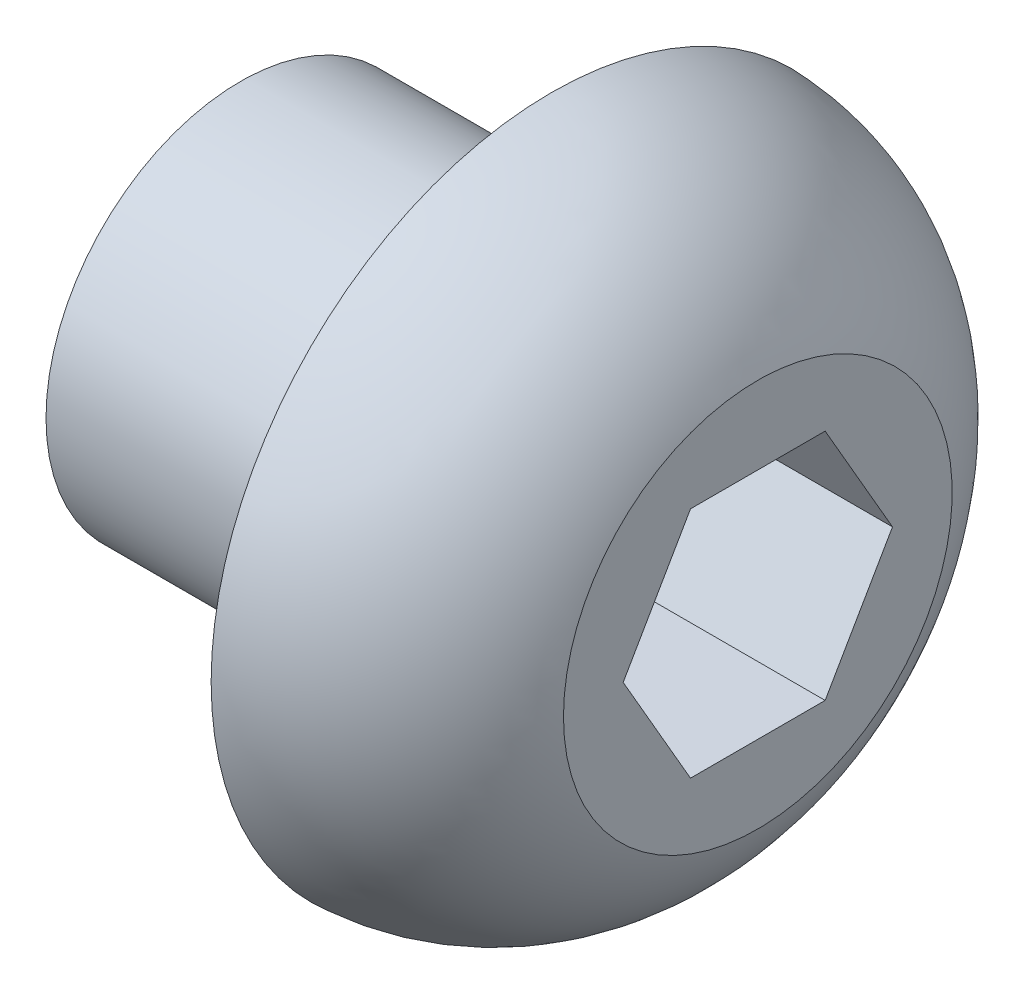
ISO-10303-21;
HEADER;
FILE_DESCRIPTION(('STEP AP214'),'2;1');
FILE_NAME('part.step','',(''),(''),'','','');
FILE_SCHEMA(('AUTOMOTIVE_DESIGN { 1 0 10303 214 1 1 1 1 }'));
ENDSEC;
DATA;
#1=APPLICATION_CONTEXT('core data for automotive mechanical design processes');
#2=APPLICATION_PROTOCOL_DEFINITION('international standard','automotive_design',2000,#1);
#3=PRODUCT_CONTEXT('',#1,'mechanical');
#4=PRODUCT('Part','Part','',(#3));
#5=PRODUCT_RELATED_PRODUCT_CATEGORY('part','',(#4));
#6=PRODUCT_DEFINITION_FORMATION('','',#4);
#7=PRODUCT_DEFINITION_CONTEXT('part definition',#1,'design');
#8=PRODUCT_DEFINITION('design','',#6,#7);
#9=PRODUCT_DEFINITION_SHAPE('','',#8);
#10=(LENGTH_UNIT() NAMED_UNIT(*) SI_UNIT(.MILLI.,.METRE.));
#11=(NAMED_UNIT(*) PLANE_ANGLE_UNIT() SI_UNIT($,.RADIAN.));
#12=(NAMED_UNIT(*) SI_UNIT($,.STERADIAN.) SOLID_ANGLE_UNIT());
#13=UNCERTAINTY_MEASURE_WITH_UNIT(LENGTH_MEASURE(1.E-05),#10,'distance_accuracy_value','');
#14=(GEOMETRIC_REPRESENTATION_CONTEXT(3) GLOBAL_UNCERTAINTY_ASSIGNED_CONTEXT((#13)) GLOBAL_UNIT_ASSIGNED_CONTEXT((#10,
#11,#12)) REPRESENTATION_CONTEXT('',''));
#15=CARTESIAN_POINT('',(0.,0.,0.));
#16=DIRECTION('',(0.,0.,1.));
#17=DIRECTION('',(1.,0.,0.));
#18=AXIS2_PLACEMENT_3D('',#15,#16,#17);
#19=CARTESIAN_POINT('',(0.,0.,0.));
#20=DIRECTION('',(1.,0.,0.));
#21=DIRECTION('',(0.,0.,-1.));
#22=AXIS2_PLACEMENT_3D('',#19,#20,#21);
#23=PLANE('',#22);
#24=CARTESIAN_POINT('',(0.,0.,0.));
#25=DIRECTION('',(-1.,0.,0.));
#26=DIRECTION('',(0.,0.,1.));
#27=AXIS2_PLACEMENT_3D('',#24,#25,#26);
#28=CIRCLE('',#27,3.96875);
#29=CARTESIAN_POINT('',(0.,0.,3.96875));
#30=VERTEX_POINT('',#29);
#31=EDGE_CURVE('E11',#30,#30,#28,.T.);
#32=ORIENTED_EDGE('',*,*,#31,.T.);
#33=EDGE_LOOP('',(#32));
#34=FACE_BOUND('',#33,.T.);
#35=ADVANCED_FACE('F32',(#34),#23,.F.);
#36=CARTESIAN_POINT('',(-7.10959552912187,0.,0.));
#37=DIRECTION('',(-1.,0.,0.));
#38=DIRECTION('',(0.,0.,1.));
#39=AXIS2_PLACEMENT_3D('',#36,#37,#38);
#40=CYLINDRICAL_SURFACE('',#39,3.96875);
#41=ORIENTED_EDGE('',*,*,#31,.F.);
#42=EDGE_LOOP('',(#41));
#43=FACE_BOUND('',#42,.T.);
#44=CARTESIAN_POINT('',(6.35,0.,0.));
#45=DIRECTION('',(-1.,0.,0.));
#46=DIRECTION('',(0.,0.,1.));
#47=AXIS2_PLACEMENT_3D('',#44,#45,#46);
#48=CIRCLE('',#47,3.96875);
#49=CARTESIAN_POINT('',(6.35,0.,3.96875));
#50=VERTEX_POINT('',#49);
#51=EDGE_CURVE('E39',#50,#50,#48,.T.);
#52=ORIENTED_EDGE('',*,*,#51,.T.);
#53=EDGE_LOOP('',(#52));
#54=FACE_BOUND('',#53,.T.);
#55=ADVANCED_FACE('F148',(#43,#54),#40,.T.);
#56=CARTESIAN_POINT('',(6.35,3.96875,0.));
#57=DIRECTION('',(1.,0.,0.));
#58=DIRECTION('',(0.,0.,-1.));
#59=AXIS2_PLACEMENT_3D('',#56,#57,#58);
#60=PLANE('',#59);
#61=ORIENTED_EDGE('',*,*,#51,.F.);
#62=EDGE_LOOP('',(#61));
#63=FACE_BOUND('',#62,.T.);
#64=CARTESIAN_POINT('',(6.35,0.,0.));
#65=DIRECTION('',(-1.,0.,0.));
#66=DIRECTION('',(0.,0.,1.));
#67=AXIS2_PLACEMENT_3D('',#64,#65,#66);
#68=CIRCLE('',#67,6.9469);
#69=CARTESIAN_POINT('',(6.35,0.,6.9469));
#70=VERTEX_POINT('',#69);
#71=EDGE_CURVE('E143',#70,#70,#68,.T.);
#72=ORIENTED_EDGE('',*,*,#71,.T.);
#73=EDGE_LOOP('',(#72));
#74=FACE_BOUND('',#73,.T.);
#75=ADVANCED_FACE('F150',(#63,#74),#60,.F.);
#76=CARTESIAN_POINT('',(6.12946561422209,0.,0.));
#77=DIRECTION('',(-1.,0.,0.));
#78=DIRECTION('',(0.,0.,1.));
#79=AXIS2_PLACEMENT_3D('',#76,#77,#78);
#80=DEGENERATE_TOROIDAL_SURFACE('',#79,2.16085350286454,4.79112476231344,.T.);
#81=ORIENTED_EDGE('',*,*,#71,.F.);
#82=EDGE_LOOP('',(#81));
#83=FACE_BOUND('',#82,.T.);
#84=CARTESIAN_POINT('',(10.5664,0.,0.));
#85=DIRECTION('',(-1.,0.,0.));
#86=DIRECTION('',(0.,0.,1.));
#87=AXIS2_PLACEMENT_3D('',#84,#85,#86);
#88=CIRCLE('',#87,3.96875);
#89=CARTESIAN_POINT('',(10.5664,0.,3.96875));
#90=VERTEX_POINT('',#89);
#91=EDGE_CURVE('E134',#90,#90,#88,.T.);
#92=ORIENTED_EDGE('',*,*,#91,.T.);
#93=EDGE_LOOP('',(#92));
#94=FACE_BOUND('',#93,.T.);
#95=ADVANCED_FACE('F153',(#83,#94),#80,.T.);
#96=CARTESIAN_POINT('',(10.5664,0.,0.));
#97=DIRECTION('',(-1.,0.,0.));
#98=DIRECTION('',(0.,0.,1.));
#99=AXIS2_PLACEMENT_3D('',#96,#97,#98);
#100=PLANE('',#99);
#101=DIRECTION('',(0.,0.866025403784439,0.5));
#102=VECTOR('',#101,1.);
#103=CARTESIAN_POINT('',(10.5664,0.,-2.74963065701559));
#104=LINE('',#103,#102);
#105=CARTESIAN_POINT('',(10.5664,0.,-2.74963065701559));
#106=VERTEX_POINT('',#105);
#107=CARTESIAN_POINT('',(10.5664,2.38125,-1.3748153285078));
#108=VERTEX_POINT('',#107);
#109=EDGE_CURVE('E100',#106,#108,#104,.T.);
#110=ORIENTED_EDGE('',*,*,#109,.F.);
#111=DIRECTION('',(0.,0.866025403784439,-0.5));
#112=VECTOR('',#111,1.);
#113=CARTESIAN_POINT('',(10.5664,-2.38125,-1.3748153285078));
#114=LINE('',#113,#112);
#115=CARTESIAN_POINT('',(10.5664,-2.38125,-1.3748153285078));
#116=VERTEX_POINT('',#115);
#117=EDGE_CURVE('E46',#116,#106,#114,.T.);
#118=ORIENTED_EDGE('',*,*,#117,.F.);
#119=DIRECTION('',(0.,0.,-1.));
#120=VECTOR('',#119,1.);
#121=CARTESIAN_POINT('',(10.5664,-2.38125,1.3748153285078));
#122=LINE('',#121,#120);
#123=CARTESIAN_POINT('',(10.5664,-2.38125,1.3748153285078));
#124=VERTEX_POINT('',#123);
#125=EDGE_CURVE('E116',#124,#116,#122,.T.);
#126=ORIENTED_EDGE('',*,*,#125,.F.);
#127=DIRECTION('',(0.,-0.866025403784439,-0.5));
#128=VECTOR('',#127,1.);
#129=CARTESIAN_POINT('',(10.5664,0.,2.74963065701559));
#130=LINE('',#129,#128);
#131=CARTESIAN_POINT('',(10.5664,0.,2.74963065701559));
#132=VERTEX_POINT('',#131);
#133=EDGE_CURVE('E110',#132,#124,#130,.T.);
#134=ORIENTED_EDGE('',*,*,#133,.F.);
#135=DIRECTION('',(0.,-0.866025403784439,0.5));
#136=VECTOR('',#135,1.);
#137=CARTESIAN_POINT('',(10.5664,2.38125,1.3748153285078));
#138=LINE('',#137,#136);
#139=CARTESIAN_POINT('',(10.5664,2.38125,1.3748153285078));
#140=VERTEX_POINT('',#139);
#141=EDGE_CURVE('E108',#140,#132,#138,.T.);
#142=ORIENTED_EDGE('',*,*,#141,.F.);
#143=DIRECTION('',(0.,0.,1.));
#144=VECTOR('',#143,1.);
#145=CARTESIAN_POINT('',(10.5664,2.38125,-1.3748153285078));
#146=LINE('',#145,#144);
#147=EDGE_CURVE('E89',#108,#140,#146,.T.);
#148=ORIENTED_EDGE('',*,*,#147,.F.);
#149=EDGE_LOOP('',(#110,#118,#126,#134,#142,#148));
#150=FACE_BOUND('',#149,.T.);
#151=ORIENTED_EDGE('',*,*,#91,.F.);
#152=EDGE_LOOP('',(#151));
#153=FACE_BOUND('',#152,.T.);
#154=ADVANCED_FACE('F104',(#150,#153),#100,.F.);
#155=CARTESIAN_POINT('',(6.7564,-2.38125,-1.3748153285078));
#156=DIRECTION('',(0.,-0.5,-0.866025403784439));
#157=DIRECTION('',(0.,0.866025403784439,-0.5));
#158=AXIS2_PLACEMENT_3D('',#155,#156,#157);
#159=PLANE('',#158);
#160=ORIENTED_EDGE('',*,*,#117,.T.);
#161=DIRECTION('',(1.,0.,0.));
#162=VECTOR('',#161,1.);
#163=CARTESIAN_POINT('',(6.7564,0.,-2.74963065701559));
#164=LINE('',#163,#162);
#165=CARTESIAN_POINT('',(6.7564,0.,-2.74963065701559));
#166=VERTEX_POINT('',#165);
#167=EDGE_CURVE('E97',#166,#106,#164,.T.);
#168=ORIENTED_EDGE('',*,*,#167,.F.);
#169=DIRECTION('',(0.,0.866025403784439,-0.5));
#170=VECTOR('',#169,1.);
#171=CARTESIAN_POINT('',(6.7564,-2.38125,-1.3748153285078));
#172=LINE('',#171,#170);
#173=CARTESIAN_POINT('',(6.7564,-2.38125,-1.3748153285078));
#174=VERTEX_POINT('',#173);
#175=EDGE_CURVE('E118',#174,#166,#172,.T.);
#176=ORIENTED_EDGE('',*,*,#175,.F.);
#177=DIRECTION('',(1.,0.,0.));
#178=VECTOR('',#177,1.);
#179=CARTESIAN_POINT('',(6.7564,-2.38125,-1.3748153285078));
#180=LINE('',#179,#178);
#181=EDGE_CURVE('E53',#174,#116,#180,.T.);
#182=ORIENTED_EDGE('',*,*,#181,.T.);
#183=EDGE_LOOP('',(#160,#168,#176,#182));
#184=FACE_BOUND('',#183,.T.);
#185=ADVANCED_FACE('F162',(#184),#159,.F.);
#186=CARTESIAN_POINT('',(6.7564,-2.38125,1.3748153285078));
#187=DIRECTION('',(0.,-1.,0.));
#188=DIRECTION('',(0.,0.,-1.));
#189=AXIS2_PLACEMENT_3D('',#186,#187,#188);
#190=PLANE('',#189);
#191=ORIENTED_EDGE('',*,*,#125,.T.);
#192=ORIENTED_EDGE('',*,*,#181,.F.);
#193=DIRECTION('',(0.,0.,-1.));
#194=VECTOR('',#193,1.);
#195=CARTESIAN_POINT('',(6.7564,-2.38125,1.3748153285078));
#196=LINE('',#195,#194);
#197=CARTESIAN_POINT('',(6.7564,-2.38125,1.3748153285078));
#198=VERTEX_POINT('',#197);
#199=EDGE_CURVE('E130',#198,#174,#196,.T.);
#200=ORIENTED_EDGE('',*,*,#199,.F.);
#201=DIRECTION('',(1.,0.,0.));
#202=VECTOR('',#201,1.);
#203=CARTESIAN_POINT('',(6.7564,-2.38125,1.3748153285078));
#204=LINE('',#203,#202);
#205=EDGE_CURVE('E135',#198,#124,#204,.T.);
#206=ORIENTED_EDGE('',*,*,#205,.T.);
#207=EDGE_LOOP('',(#191,#192,#200,#206));
#208=FACE_BOUND('',#207,.T.);
#209=ADVANCED_FACE('F167',(#208),#190,.F.);
#210=CARTESIAN_POINT('',(6.7564,0.,2.74963065701559));
#211=DIRECTION('',(0.,-0.5,0.866025403784439));
#212=DIRECTION('',(0.,-0.866025403784439,-0.5));
#213=AXIS2_PLACEMENT_3D('',#210,#211,#212);
#214=PLANE('',#213);
#215=ORIENTED_EDGE('',*,*,#133,.T.);
#216=ORIENTED_EDGE('',*,*,#205,.F.);
#217=DIRECTION('',(0.,-0.866025403784439,-0.5));
#218=VECTOR('',#217,1.);
#219=CARTESIAN_POINT('',(6.7564,0.,2.74963065701559));
#220=LINE('',#219,#218);
#221=CARTESIAN_POINT('',(6.7564,0.,2.74963065701559));
#222=VERTEX_POINT('',#221);
#223=EDGE_CURVE('E127',#222,#198,#220,.T.);
#224=ORIENTED_EDGE('',*,*,#223,.F.);
#225=DIRECTION('',(1.,0.,0.));
#226=VECTOR('',#225,1.);
#227=CARTESIAN_POINT('',(6.7564,0.,2.74963065701559));
#228=LINE('',#227,#226);
#229=EDGE_CURVE('E137',#222,#132,#228,.T.);
#230=ORIENTED_EDGE('',*,*,#229,.T.);
#231=EDGE_LOOP('',(#215,#216,#224,#230));
#232=FACE_BOUND('',#231,.T.);
#233=ADVANCED_FACE('F205',(#232),#214,.F.);
#234=CARTESIAN_POINT('',(6.7564,2.38125,1.3748153285078));
#235=DIRECTION('',(0.,0.5,0.866025403784439));
#236=DIRECTION('',(0.,-0.866025403784439,0.5));
#237=AXIS2_PLACEMENT_3D('',#234,#235,#236);
#238=PLANE('',#237);
#239=ORIENTED_EDGE('',*,*,#141,.T.);
#240=ORIENTED_EDGE('',*,*,#229,.F.);
#241=DIRECTION('',(0.,-0.866025403784439,0.5));
#242=VECTOR('',#241,1.);
#243=CARTESIAN_POINT('',(6.7564,2.38125,1.3748153285078));
#244=LINE('',#243,#242);
#245=CARTESIAN_POINT('',(6.7564,2.38125,1.3748153285078));
#246=VERTEX_POINT('',#245);
#247=EDGE_CURVE('E124',#246,#222,#244,.T.);
#248=ORIENTED_EDGE('',*,*,#247,.F.);
#249=DIRECTION('',(1.,0.,0.));
#250=VECTOR('',#249,1.);
#251=CARTESIAN_POINT('',(6.7564,2.38125,1.3748153285078));
#252=LINE('',#251,#250);
#253=EDGE_CURVE('E96',#246,#140,#252,.T.);
#254=ORIENTED_EDGE('',*,*,#253,.T.);
#255=EDGE_LOOP('',(#239,#240,#248,#254));
#256=FACE_BOUND('',#255,.T.);
#257=ADVANCED_FACE('F214',(#256),#238,.F.);
#258=CARTESIAN_POINT('',(6.7564,2.38125,-1.3748153285078));
#259=DIRECTION('',(0.,1.,0.));
#260=DIRECTION('',(0.,0.,1.));
#261=AXIS2_PLACEMENT_3D('',#258,#259,#260);
#262=PLANE('',#261);
#263=ORIENTED_EDGE('',*,*,#147,.T.);
#264=ORIENTED_EDGE('',*,*,#253,.F.);
#265=DIRECTION('',(0.,0.,1.));
#266=VECTOR('',#265,1.);
#267=CARTESIAN_POINT('',(6.7564,2.38125,-1.3748153285078));
#268=LINE('',#267,#266);
#269=CARTESIAN_POINT('',(6.7564,2.38125,-1.3748153285078));
#270=VERTEX_POINT('',#269);
#271=EDGE_CURVE('E92',#270,#246,#268,.T.);
#272=ORIENTED_EDGE('',*,*,#271,.F.);
#273=DIRECTION('',(1.,0.,0.));
#274=VECTOR('',#273,1.);
#275=CARTESIAN_POINT('',(6.7564,2.38125,-1.3748153285078));
#276=LINE('',#275,#274);
#277=EDGE_CURVE('E85',#270,#108,#276,.T.);
#278=ORIENTED_EDGE('',*,*,#277,.T.);
#279=EDGE_LOOP('',(#263,#264,#272,#278));
#280=FACE_BOUND('',#279,.T.);
#281=ADVANCED_FACE('F87',(#280),#262,.F.);
#282=CARTESIAN_POINT('',(6.7564,0.,-2.74963065701559));
#283=DIRECTION('',(0.,0.5,-0.866025403784439));
#284=DIRECTION('',(0.,0.866025403784439,0.5));
#285=AXIS2_PLACEMENT_3D('',#282,#283,#284);
#286=PLANE('',#285);
#287=ORIENTED_EDGE('',*,*,#109,.T.);
#288=ORIENTED_EDGE('',*,*,#277,.F.);
#289=DIRECTION('',(0.,0.866025403784439,0.5));
#290=VECTOR('',#289,1.);
#291=CARTESIAN_POINT('',(6.7564,0.,-2.74963065701559));
#292=LINE('',#291,#290);
#293=EDGE_CURVE('E121',#166,#270,#292,.T.);
#294=ORIENTED_EDGE('',*,*,#293,.F.);
#295=ORIENTED_EDGE('',*,*,#167,.T.);
#296=EDGE_LOOP('',(#287,#288,#294,#295));
#297=FACE_BOUND('',#296,.T.);
#298=ADVANCED_FACE('F101',(#297),#286,.F.);
#299=CARTESIAN_POINT('',(6.7564,-2.38125,-1.3748153285078));
#300=DIRECTION('',(-1.,0.,0.));
#301=DIRECTION('',(0.,0.,1.));
#302=AXIS2_PLACEMENT_3D('',#299,#300,#301);
#303=PLANE('',#302);
#304=ORIENTED_EDGE('',*,*,#175,.T.);
#305=ORIENTED_EDGE('',*,*,#293,.T.);
#306=ORIENTED_EDGE('',*,*,#271,.T.);
#307=ORIENTED_EDGE('',*,*,#247,.T.);
#308=ORIENTED_EDGE('',*,*,#223,.T.);
#309=ORIENTED_EDGE('',*,*,#199,.T.);
#310=EDGE_LOOP('',(#304,#305,#306,#307,#308,#309));
#311=FACE_BOUND('',#310,.T.);
#312=ADVANCED_FACE('F241',(#311),#303,.F.);
#313=CLOSED_SHELL('',(#35,#55,#75,#95,#154,#185,#209,#233,#257,#281,#298,#312));
#314=MANIFOLD_SOLID_BREP('B2',#313);
#315=ADVANCED_BREP_SHAPE_REPRESENTATION('',(#18,#314),#14);
#316=SHAPE_DEFINITION_REPRESENTATION(#9,#315);
ENDSEC;
END-ISO-10303-21;
